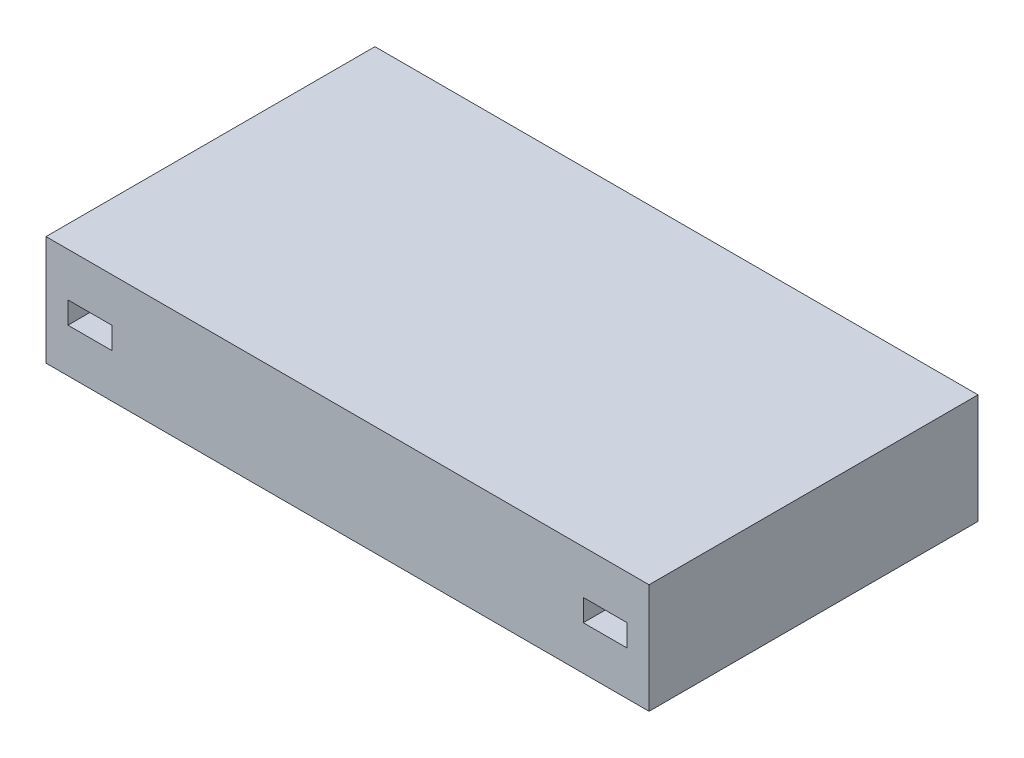
ISO-10303-21;
HEADER;
FILE_DESCRIPTION(('STEP AP214'),'2;1');
FILE_NAME('part.step','',(''),(''),'','','');
FILE_SCHEMA(('AUTOMOTIVE_DESIGN { 1 0 10303 214 1 1 1 1 }'));
ENDSEC;
DATA;
#1=APPLICATION_CONTEXT('core data for automotive mechanical design processes');
#2=APPLICATION_PROTOCOL_DEFINITION('international standard','automotive_design',2000,#1);
#3=PRODUCT_CONTEXT('',#1,'mechanical');
#4=PRODUCT('Part','Part','',(#3));
#5=PRODUCT_RELATED_PRODUCT_CATEGORY('part','',(#4));
#6=PRODUCT_DEFINITION_FORMATION('','',#4);
#7=PRODUCT_DEFINITION_CONTEXT('part definition',#1,'design');
#8=PRODUCT_DEFINITION('design','',#6,#7);
#9=PRODUCT_DEFINITION_SHAPE('','',#8);
#10=(LENGTH_UNIT() NAMED_UNIT(*) SI_UNIT(.MILLI.,.METRE.));
#11=(NAMED_UNIT(*) PLANE_ANGLE_UNIT() SI_UNIT($,.RADIAN.));
#12=(NAMED_UNIT(*) SI_UNIT($,.STERADIAN.) SOLID_ANGLE_UNIT());
#13=UNCERTAINTY_MEASURE_WITH_UNIT(LENGTH_MEASURE(1.E-05),#10,'distance_accuracy_value','');
#14=(GEOMETRIC_REPRESENTATION_CONTEXT(3) GLOBAL_UNCERTAINTY_ASSIGNED_CONTEXT((#13)) GLOBAL_UNIT_ASSIGNED_CONTEXT((#10,
#11,#12)) REPRESENTATION_CONTEXT('',''));
#15=CARTESIAN_POINT('',(0.,0.,0.));
#16=DIRECTION('',(0.,0.,1.));
#17=DIRECTION('',(1.,0.,0.));
#18=AXIS2_PLACEMENT_3D('',#15,#16,#17);
#19=CARTESIAN_POINT('',(550.,0.,-300.));
#20=DIRECTION('',(0.,0.,1.));
#21=DIRECTION('',(1.,0.,0.));
#22=AXIS2_PLACEMENT_3D('',#19,#20,#21);
#23=PLANE('',#22);
#24=DIRECTION('',(0.,-1.,0.));
#25=VECTOR('',#24,1.);
#26=CARTESIAN_POINT('',(490.,60.,-300.));
#27=LINE('',#26,#25);
#28=CARTESIAN_POINT('',(490.,60.,-300.));
#29=VERTEX_POINT('',#28);
#30=CARTESIAN_POINT('',(490.,40.,-300.));
#31=VERTEX_POINT('',#30);
#32=EDGE_CURVE('E57',#29,#31,#27,.T.);
#33=ORIENTED_EDGE('',*,*,#32,.T.);
#34=DIRECTION('',(1.,0.,0.));
#35=VECTOR('',#34,1.);
#36=CARTESIAN_POINT('',(490.,40.,-300.));
#37=LINE('',#36,#35);
#38=CARTESIAN_POINT('',(530.,40.,-300.));
#39=VERTEX_POINT('',#38);
#40=EDGE_CURVE('E217',#31,#39,#37,.T.);
#41=ORIENTED_EDGE('',*,*,#40,.T.);
#42=DIRECTION('',(0.,1.,0.));
#43=VECTOR('',#42,1.);
#44=CARTESIAN_POINT('',(530.,60.,-300.));
#45=LINE('',#44,#43);
#46=CARTESIAN_POINT('',(530.,60.,-300.));
#47=VERTEX_POINT('',#46);
#48=EDGE_CURVE('E228',#39,#47,#45,.T.);
#49=ORIENTED_EDGE('',*,*,#48,.T.);
#50=DIRECTION('',(-1.,0.,0.));
#51=VECTOR('',#50,1.);
#52=CARTESIAN_POINT('',(490.,60.,-300.));
#53=LINE('',#52,#51);
#54=EDGE_CURVE('E225',#47,#29,#53,.T.);
#55=ORIENTED_EDGE('',*,*,#54,.T.);
#56=EDGE_LOOP('',(#33,#41,#49,#55));
#57=FACE_BOUND('',#56,.T.);
#58=DIRECTION('',(0.,1.,0.));
#59=VECTOR('',#58,1.);
#60=CARTESIAN_POINT('',(0.,0.,-300.));
#61=LINE('',#60,#59);
#62=CARTESIAN_POINT('',(0.,0.,-300.));
#63=VERTEX_POINT('',#62);
#64=CARTESIAN_POINT('',(0.,100.,-300.));
#65=VERTEX_POINT('',#64);
#66=EDGE_CURVE('E318',#63,#65,#61,.T.);
#67=ORIENTED_EDGE('',*,*,#66,.T.);
#68=DIRECTION('',(-1.,0.,0.));
#69=VECTOR('',#68,1.);
#70=CARTESIAN_POINT('',(550.,100.,-300.));
#71=LINE('',#70,#69);
#72=CARTESIAN_POINT('',(550.,100.,-300.));
#73=VERTEX_POINT('',#72);
#74=EDGE_CURVE('E323',#73,#65,#71,.T.);
#75=ORIENTED_EDGE('',*,*,#74,.F.);
#76=DIRECTION('',(0.,1.,0.));
#77=VECTOR('',#76,1.);
#78=CARTESIAN_POINT('',(550.,0.,-300.));
#79=LINE('',#78,#77);
#80=CARTESIAN_POINT('',(550.,0.,-300.));
#81=VERTEX_POINT('',#80);
#82=EDGE_CURVE('E309',#81,#73,#79,.T.);
#83=ORIENTED_EDGE('',*,*,#82,.F.);
#84=DIRECTION('',(-1.,0.,0.));
#85=VECTOR('',#84,1.);
#86=CARTESIAN_POINT('',(550.,0.,-300.));
#87=LINE('',#86,#85);
#88=EDGE_CURVE('E42',#81,#63,#87,.T.);
#89=ORIENTED_EDGE('',*,*,#88,.T.);
#90=EDGE_LOOP('',(#67,#75,#83,#89));
#91=FACE_BOUND('',#90,.T.);
#92=DIRECTION('',(0.,-1.,0.));
#93=VECTOR('',#92,1.);
#94=CARTESIAN_POINT('',(20.,60.,-300.));
#95=LINE('',#94,#93);
#96=CARTESIAN_POINT('',(20.,60.,-300.));
#97=VERTEX_POINT('',#96);
#98=CARTESIAN_POINT('',(20.,40.,-300.));
#99=VERTEX_POINT('',#98);
#100=EDGE_CURVE('E49',#97,#99,#95,.T.);
#101=ORIENTED_EDGE('',*,*,#100,.T.);
#102=DIRECTION('',(1.,0.,0.));
#103=VECTOR('',#102,1.);
#104=CARTESIAN_POINT('',(20.,40.,-300.));
#105=LINE('',#104,#103);
#106=CARTESIAN_POINT('',(60.,40.,-300.));
#107=VERTEX_POINT('',#106);
#108=EDGE_CURVE('E193',#99,#107,#105,.T.);
#109=ORIENTED_EDGE('',*,*,#108,.T.);
#110=DIRECTION('',(0.,1.,0.));
#111=VECTOR('',#110,1.);
#112=CARTESIAN_POINT('',(60.,60.,-300.));
#113=LINE('',#112,#111);
#114=CARTESIAN_POINT('',(60.,60.,-300.));
#115=VERTEX_POINT('',#114);
#116=EDGE_CURVE('E196',#107,#115,#113,.T.);
#117=ORIENTED_EDGE('',*,*,#116,.T.);
#118=DIRECTION('',(-1.,0.,0.));
#119=VECTOR('',#118,1.);
#120=CARTESIAN_POINT('',(20.,60.,-300.));
#121=LINE('',#120,#119);
#122=EDGE_CURVE('E202',#115,#97,#121,.T.);
#123=ORIENTED_EDGE('',*,*,#122,.T.);
#124=EDGE_LOOP('',(#101,#109,#117,#123));
#125=FACE_BOUND('',#124,.T.);
#126=ADVANCED_FACE('F34',(#57,#91,#125),#23,.F.);
#127=CARTESIAN_POINT('',(550.,0.,0.));
#128=DIRECTION('',(0.,0.,-1.));
#129=DIRECTION('',(0.,1.,0.));
#130=AXIS2_PLACEMENT_3D('',#127,#128,#129);
#131=PLANE('',#130);
#132=DIRECTION('',(1.,0.,0.));
#133=VECTOR('',#132,1.);
#134=CARTESIAN_POINT('',(20.,40.,0.));
#135=LINE('',#134,#133);
#136=CARTESIAN_POINT('',(20.,40.,0.));
#137=VERTEX_POINT('',#136);
#138=CARTESIAN_POINT('',(60.,40.,0.));
#139=VERTEX_POINT('',#138);
#140=EDGE_CURVE('E255',#137,#139,#135,.T.);
#141=ORIENTED_EDGE('',*,*,#140,.F.);
#142=DIRECTION('',(0.,-1.,0.));
#143=VECTOR('',#142,1.);
#144=CARTESIAN_POINT('',(20.,60.,0.));
#145=LINE('',#144,#143);
#146=CARTESIAN_POINT('',(20.,60.,0.));
#147=VERTEX_POINT('',#146);
#148=EDGE_CURVE('E253',#147,#137,#145,.T.);
#149=ORIENTED_EDGE('',*,*,#148,.F.);
#150=DIRECTION('',(-1.,0.,0.));
#151=VECTOR('',#150,1.);
#152=CARTESIAN_POINT('',(20.,60.,0.));
#153=LINE('',#152,#151);
#154=CARTESIAN_POINT('',(60.,60.,0.));
#155=VERTEX_POINT('',#154);
#156=EDGE_CURVE('E243',#155,#147,#153,.T.);
#157=ORIENTED_EDGE('',*,*,#156,.F.);
#158=DIRECTION('',(0.,1.,0.));
#159=VECTOR('',#158,1.);
#160=CARTESIAN_POINT('',(60.,60.,0.));
#161=LINE('',#160,#159);
#162=EDGE_CURVE('E259',#139,#155,#161,.T.);
#163=ORIENTED_EDGE('',*,*,#162,.F.);
#164=EDGE_LOOP('',(#141,#149,#157,#163));
#165=FACE_BOUND('',#164,.T.);
#166=DIRECTION('',(1.,0.,0.));
#167=VECTOR('',#166,1.);
#168=CARTESIAN_POINT('',(490.,40.,0.));
#169=LINE('',#168,#167);
#170=CARTESIAN_POINT('',(490.,40.,0.));
#171=VERTEX_POINT('',#170);
#172=CARTESIAN_POINT('',(530.,40.,0.));
#173=VERTEX_POINT('',#172);
#174=EDGE_CURVE('E288',#171,#173,#169,.T.);
#175=ORIENTED_EDGE('',*,*,#174,.F.);
#176=DIRECTION('',(0.,-1.,0.));
#177=VECTOR('',#176,1.);
#178=CARTESIAN_POINT('',(490.,60.,0.));
#179=LINE('',#178,#177);
#180=CARTESIAN_POINT('',(490.,60.,0.));
#181=VERTEX_POINT('',#180);
#182=EDGE_CURVE('E209',#181,#171,#179,.T.);
#183=ORIENTED_EDGE('',*,*,#182,.F.);
#184=DIRECTION('',(-1.,0.,0.));
#185=VECTOR('',#184,1.);
#186=CARTESIAN_POINT('',(490.,60.,0.));
#187=LINE('',#186,#185);
#188=CARTESIAN_POINT('',(530.,60.,0.));
#189=VERTEX_POINT('',#188);
#190=EDGE_CURVE('E277',#189,#181,#187,.T.);
#191=ORIENTED_EDGE('',*,*,#190,.F.);
#192=DIRECTION('',(0.,1.,0.));
#193=VECTOR('',#192,1.);
#194=CARTESIAN_POINT('',(530.,60.,0.));
#195=LINE('',#194,#193);
#196=EDGE_CURVE('E291',#173,#189,#195,.T.);
#197=ORIENTED_EDGE('',*,*,#196,.F.);
#198=EDGE_LOOP('',(#175,#183,#191,#197));
#199=FACE_BOUND('',#198,.T.);
#200=DIRECTION('',(0.,-1.,0.));
#201=VECTOR('',#200,1.);
#202=CARTESIAN_POINT('',(0.,0.,0.));
#203=LINE('',#202,#201);
#204=CARTESIAN_POINT('',(0.,100.,0.));
#205=VERTEX_POINT('',#204);
#206=CARTESIAN_POINT('',(0.,0.,0.));
#207=VERTEX_POINT('',#206);
#208=EDGE_CURVE('E266',#205,#207,#203,.T.);
#209=ORIENTED_EDGE('',*,*,#208,.T.);
#210=DIRECTION('',(-1.,0.,0.));
#211=VECTOR('',#210,1.);
#212=CARTESIAN_POINT('',(550.,0.,0.));
#213=LINE('',#212,#211);
#214=CARTESIAN_POINT('',(550.,0.,0.));
#215=VERTEX_POINT('',#214);
#216=EDGE_CURVE('E11',#215,#207,#213,.T.);
#217=ORIENTED_EDGE('',*,*,#216,.F.);
#218=DIRECTION('',(0.,-1.,0.));
#219=VECTOR('',#218,1.);
#220=CARTESIAN_POINT('',(550.,0.,0.));
#221=LINE('',#220,#219);
#222=CARTESIAN_POINT('',(550.,100.,0.));
#223=VERTEX_POINT('',#222);
#224=EDGE_CURVE('E303',#223,#215,#221,.T.);
#225=ORIENTED_EDGE('',*,*,#224,.F.);
#226=DIRECTION('',(-1.,0.,0.));
#227=VECTOR('',#226,1.);
#228=CARTESIAN_POINT('',(550.,100.,0.));
#229=LINE('',#228,#227);
#230=EDGE_CURVE('E313',#223,#205,#229,.T.);
#231=ORIENTED_EDGE('',*,*,#230,.T.);
#232=EDGE_LOOP('',(#209,#217,#225,#231));
#233=FACE_BOUND('',#232,.T.);
#234=ADVANCED_FACE('F36',(#165,#199,#233),#131,.F.);
#235=CARTESIAN_POINT('',(550.,0.,0.));
#236=DIRECTION('',(0.,1.,0.));
#237=DIRECTION('',(0.,0.,1.));
#238=AXIS2_PLACEMENT_3D('',#235,#236,#237);
#239=PLANE('',#238);
#240=DIRECTION('',(0.,0.,-1.));
#241=VECTOR('',#240,1.);
#242=CARTESIAN_POINT('',(0.,0.,0.));
#243=LINE('',#242,#241);
#244=EDGE_CURVE('E316',#207,#63,#243,.T.);
#245=ORIENTED_EDGE('',*,*,#244,.T.);
#246=ORIENTED_EDGE('',*,*,#88,.F.);
#247=DIRECTION('',(0.,0.,-1.));
#248=VECTOR('',#247,1.);
#249=CARTESIAN_POINT('',(550.,0.,0.));
#250=LINE('',#249,#248);
#251=EDGE_CURVE('E306',#215,#81,#250,.T.);
#252=ORIENTED_EDGE('',*,*,#251,.F.);
#253=ORIENTED_EDGE('',*,*,#216,.T.);
#254=EDGE_LOOP('',(#245,#246,#252,#253));
#255=FACE_BOUND('',#254,.T.);
#256=ADVANCED_FACE('F346',(#255),#239,.F.);
#257=CARTESIAN_POINT('',(550.,100.,0.));
#258=DIRECTION('',(0.,-1.,0.));
#259=DIRECTION('',(0.,0.,-1.));
#260=AXIS2_PLACEMENT_3D('',#257,#258,#259);
#261=PLANE('',#260);
#262=DIRECTION('',(0.,0.,1.));
#263=VECTOR('',#262,1.);
#264=CARTESIAN_POINT('',(0.,100.,0.));
#265=LINE('',#264,#263);
#266=EDGE_CURVE('E307',#65,#205,#265,.T.);
#267=ORIENTED_EDGE('',*,*,#266,.T.);
#268=ORIENTED_EDGE('',*,*,#230,.F.);
#269=DIRECTION('',(0.,0.,1.));
#270=VECTOR('',#269,1.);
#271=CARTESIAN_POINT('',(550.,100.,0.));
#272=LINE('',#271,#270);
#273=EDGE_CURVE('E311',#73,#223,#272,.T.);
#274=ORIENTED_EDGE('',*,*,#273,.F.);
#275=ORIENTED_EDGE('',*,*,#74,.T.);
#276=EDGE_LOOP('',(#267,#268,#274,#275));
#277=FACE_BOUND('',#276,.T.);
#278=ADVANCED_FACE('F339',(#277),#261,.F.);
#279=CARTESIAN_POINT('',(550.,0.,0.));
#280=DIRECTION('',(-1.,0.,0.));
#281=DIRECTION('',(0.,0.,1.));
#282=AXIS2_PLACEMENT_3D('',#279,#280,#281);
#283=PLANE('',#282);
#284=ORIENTED_EDGE('',*,*,#224,.T.);
#285=ORIENTED_EDGE('',*,*,#251,.T.);
#286=ORIENTED_EDGE('',*,*,#82,.T.);
#287=ORIENTED_EDGE('',*,*,#273,.T.);
#288=EDGE_LOOP('',(#284,#285,#286,#287));
#289=FACE_BOUND('',#288,.T.);
#290=ADVANCED_FACE('F345',(#289),#283,.F.);
#291=CARTESIAN_POINT('',(0.,0.,0.));
#292=DIRECTION('',(-1.,0.,0.));
#293=DIRECTION('',(0.,0.,1.));
#294=AXIS2_PLACEMENT_3D('',#291,#292,#293);
#295=PLANE('',#294);
#296=ORIENTED_EDGE('',*,*,#208,.F.);
#297=ORIENTED_EDGE('',*,*,#266,.F.);
#298=ORIENTED_EDGE('',*,*,#66,.F.);
#299=ORIENTED_EDGE('',*,*,#244,.F.);
#300=EDGE_LOOP('',(#296,#297,#298,#299));
#301=FACE_BOUND('',#300,.T.);
#302=ADVANCED_FACE('F336',(#301),#295,.T.);
#303=CARTESIAN_POINT('',(490.,60.,-25.));
#304=DIRECTION('',(-1.,0.,0.));
#305=DIRECTION('',(0.,0.,1.));
#306=AXIS2_PLACEMENT_3D('',#303,#304,#305);
#307=PLANE('',#306);
#308=ORIENTED_EDGE('',*,*,#182,.T.);
#309=DIRECTION('',(0.,0.,1.));
#310=VECTOR('',#309,1.);
#311=CARTESIAN_POINT('',(490.,40.,-25.));
#312=LINE('',#311,#310);
#313=CARTESIAN_POINT('',(490.,40.,-25.));
#314=VERTEX_POINT('',#313);
#315=EDGE_CURVE('E286',#314,#171,#312,.T.);
#316=ORIENTED_EDGE('',*,*,#315,.F.);
#317=DIRECTION('',(0.,-1.,0.));
#318=VECTOR('',#317,1.);
#319=CARTESIAN_POINT('',(490.,60.,-25.));
#320=LINE('',#319,#318);
#321=CARTESIAN_POINT('',(490.,60.,-25.));
#322=VERTEX_POINT('',#321);
#323=EDGE_CURVE('E273',#322,#314,#320,.T.);
#324=ORIENTED_EDGE('',*,*,#323,.F.);
#325=DIRECTION('',(0.,0.,1.));
#326=VECTOR('',#325,1.);
#327=CARTESIAN_POINT('',(490.,60.,-25.));
#328=LINE('',#327,#326);
#329=EDGE_CURVE('E256',#322,#181,#328,.T.);
#330=ORIENTED_EDGE('',*,*,#329,.T.);
#331=EDGE_LOOP('',(#308,#316,#324,#330));
#332=FACE_BOUND('',#331,.T.);
#333=ADVANCED_FACE('F362',(#332),#307,.F.);
#334=CARTESIAN_POINT('',(490.,60.,-25.));
#335=DIRECTION('',(0.,1.,0.));
#336=DIRECTION('',(0.,0.,1.));
#337=AXIS2_PLACEMENT_3D('',#334,#335,#336);
#338=PLANE('',#337);
#339=ORIENTED_EDGE('',*,*,#190,.T.);
#340=ORIENTED_EDGE('',*,*,#329,.F.);
#341=DIRECTION('',(-1.,0.,0.));
#342=VECTOR('',#341,1.);
#343=CARTESIAN_POINT('',(490.,60.,-25.));
#344=LINE('',#343,#342);
#345=CARTESIAN_POINT('',(530.,60.,-25.));
#346=VERTEX_POINT('',#345);
#347=EDGE_CURVE('E283',#346,#322,#344,.T.);
#348=ORIENTED_EDGE('',*,*,#347,.F.);
#349=DIRECTION('',(0.,0.,1.));
#350=VECTOR('',#349,1.);
#351=CARTESIAN_POINT('',(530.,60.,-25.));
#352=LINE('',#351,#350);
#353=EDGE_CURVE('E297',#346,#189,#352,.T.);
#354=ORIENTED_EDGE('',*,*,#353,.T.);
#355=EDGE_LOOP('',(#339,#340,#348,#354));
#356=FACE_BOUND('',#355,.T.);
#357=ADVANCED_FACE('F367',(#356),#338,.F.);
#358=CARTESIAN_POINT('',(530.,60.,-25.));
#359=DIRECTION('',(1.,0.,0.));
#360=DIRECTION('',(0.,0.,-1.));
#361=AXIS2_PLACEMENT_3D('',#358,#359,#360);
#362=PLANE('',#361);
#363=ORIENTED_EDGE('',*,*,#196,.T.);
#364=ORIENTED_EDGE('',*,*,#353,.F.);
#365=DIRECTION('',(0.,1.,0.));
#366=VECTOR('',#365,1.);
#367=CARTESIAN_POINT('',(530.,60.,-25.));
#368=LINE('',#367,#366);
#369=CARTESIAN_POINT('',(530.,40.,-25.));
#370=VERTEX_POINT('',#369);
#371=EDGE_CURVE('E280',#370,#346,#368,.T.);
#372=ORIENTED_EDGE('',*,*,#371,.F.);
#373=DIRECTION('',(0.,0.,1.));
#374=VECTOR('',#373,1.);
#375=CARTESIAN_POINT('',(530.,40.,-25.));
#376=LINE('',#375,#374);
#377=EDGE_CURVE('E299',#370,#173,#376,.T.);
#378=ORIENTED_EDGE('',*,*,#377,.T.);
#379=EDGE_LOOP('',(#363,#364,#372,#378));
#380=FACE_BOUND('',#379,.T.);
#381=ADVANCED_FACE('F373',(#380),#362,.F.);
#382=CARTESIAN_POINT('',(490.,40.,-25.));
#383=DIRECTION('',(0.,-1.,0.));
#384=DIRECTION('',(1.,0.,0.));
#385=AXIS2_PLACEMENT_3D('',#382,#383,#384);
#386=PLANE('',#385);
#387=ORIENTED_EDGE('',*,*,#174,.T.);
#388=ORIENTED_EDGE('',*,*,#377,.F.);
#389=DIRECTION('',(1.,0.,0.));
#390=VECTOR('',#389,1.);
#391=CARTESIAN_POINT('',(490.,40.,-25.));
#392=LINE('',#391,#390);
#393=EDGE_CURVE('E276',#314,#370,#392,.T.);
#394=ORIENTED_EDGE('',*,*,#393,.F.);
#395=ORIENTED_EDGE('',*,*,#315,.T.);
#396=EDGE_LOOP('',(#387,#388,#394,#395));
#397=FACE_BOUND('',#396,.T.);
#398=ADVANCED_FACE('F369',(#397),#386,.F.);
#399=CARTESIAN_POINT('',(0.,0.,-25.));
#400=DIRECTION('',(0.,0.,1.));
#401=DIRECTION('',(1.,0.,0.));
#402=AXIS2_PLACEMENT_3D('',#399,#400,#401);
#403=PLANE('',#402);
#404=ORIENTED_EDGE('',*,*,#323,.T.);
#405=ORIENTED_EDGE('',*,*,#393,.T.);
#406=ORIENTED_EDGE('',*,*,#371,.T.);
#407=ORIENTED_EDGE('',*,*,#347,.T.);
#408=EDGE_LOOP('',(#404,#405,#406,#407));
#409=FACE_BOUND('',#408,.T.);
#410=ADVANCED_FACE('F372',(#409),#403,.T.);
#411=CARTESIAN_POINT('',(20.,60.,-25.));
#412=DIRECTION('',(-1.,0.,0.));
#413=DIRECTION('',(0.,-1.,0.));
#414=AXIS2_PLACEMENT_3D('',#411,#412,#413);
#415=PLANE('',#414);
#416=ORIENTED_EDGE('',*,*,#148,.T.);
#417=DIRECTION('',(0.,0.,1.));
#418=VECTOR('',#417,1.);
#419=CARTESIAN_POINT('',(20.,40.,-25.));
#420=LINE('',#419,#418);
#421=CARTESIAN_POINT('',(20.,40.,-25.));
#422=VERTEX_POINT('',#421);
#423=EDGE_CURVE('E252',#422,#137,#420,.T.);
#424=ORIENTED_EDGE('',*,*,#423,.F.);
#425=DIRECTION('',(0.,-1.,0.));
#426=VECTOR('',#425,1.);
#427=CARTESIAN_POINT('',(20.,60.,-25.));
#428=LINE('',#427,#426);
#429=CARTESIAN_POINT('',(20.,60.,-25.));
#430=VERTEX_POINT('',#429);
#431=EDGE_CURVE('E239',#430,#422,#428,.T.);
#432=ORIENTED_EDGE('',*,*,#431,.F.);
#433=DIRECTION('',(0.,0.,1.));
#434=VECTOR('',#433,1.);
#435=CARTESIAN_POINT('',(20.,60.,-25.));
#436=LINE('',#435,#434);
#437=EDGE_CURVE('E264',#430,#147,#436,.T.);
#438=ORIENTED_EDGE('',*,*,#437,.T.);
#439=EDGE_LOOP('',(#416,#424,#432,#438));
#440=FACE_BOUND('',#439,.T.);
#441=ADVANCED_FACE('F383',(#440),#415,.F.);
#442=CARTESIAN_POINT('',(20.,60.,-25.));
#443=DIRECTION('',(0.,1.,0.));
#444=DIRECTION('',(0.,0.,1.));
#445=AXIS2_PLACEMENT_3D('',#442,#443,#444);
#446=PLANE('',#445);
#447=ORIENTED_EDGE('',*,*,#156,.T.);
#448=ORIENTED_EDGE('',*,*,#437,.F.);
#449=DIRECTION('',(-1.,0.,0.));
#450=VECTOR('',#449,1.);
#451=CARTESIAN_POINT('',(20.,60.,-25.));
#452=LINE('',#451,#450);
#453=CARTESIAN_POINT('',(60.,60.,-25.));
#454=VERTEX_POINT('',#453);
#455=EDGE_CURVE('E249',#454,#430,#452,.T.);
#456=ORIENTED_EDGE('',*,*,#455,.F.);
#457=DIRECTION('',(0.,0.,1.));
#458=VECTOR('',#457,1.);
#459=CARTESIAN_POINT('',(60.,60.,-25.));
#460=LINE('',#459,#458);
#461=EDGE_CURVE('E267',#454,#155,#460,.T.);
#462=ORIENTED_EDGE('',*,*,#461,.T.);
#463=EDGE_LOOP('',(#447,#448,#456,#462));
#464=FACE_BOUND('',#463,.T.);
#465=ADVANCED_FACE('F387',(#464),#446,.F.);
#466=CARTESIAN_POINT('',(60.,60.,-25.));
#467=DIRECTION('',(1.,0.,0.));
#468=DIRECTION('',(0.,1.,0.));
#469=AXIS2_PLACEMENT_3D('',#466,#467,#468);
#470=PLANE('',#469);
#471=ORIENTED_EDGE('',*,*,#162,.T.);
#472=ORIENTED_EDGE('',*,*,#461,.F.);
#473=DIRECTION('',(0.,1.,0.));
#474=VECTOR('',#473,1.);
#475=CARTESIAN_POINT('',(60.,60.,-25.));
#476=LINE('',#475,#474);
#477=CARTESIAN_POINT('',(60.,40.,-25.));
#478=VERTEX_POINT('',#477);
#479=EDGE_CURVE('E246',#478,#454,#476,.T.);
#480=ORIENTED_EDGE('',*,*,#479,.F.);
#481=DIRECTION('',(0.,0.,1.));
#482=VECTOR('',#481,1.);
#483=CARTESIAN_POINT('',(60.,40.,-25.));
#484=LINE('',#483,#482);
#485=EDGE_CURVE('E269',#478,#139,#484,.T.);
#486=ORIENTED_EDGE('',*,*,#485,.T.);
#487=EDGE_LOOP('',(#471,#472,#480,#486));
#488=FACE_BOUND('',#487,.T.);
#489=ADVANCED_FACE('F393',(#488),#470,.F.);
#490=CARTESIAN_POINT('',(20.,40.,-25.));
#491=DIRECTION('',(0.,-1.,0.));
#492=DIRECTION('',(0.,0.,-1.));
#493=AXIS2_PLACEMENT_3D('',#490,#491,#492);
#494=PLANE('',#493);
#495=ORIENTED_EDGE('',*,*,#140,.T.);
#496=ORIENTED_EDGE('',*,*,#485,.F.);
#497=DIRECTION('',(1.,0.,0.));
#498=VECTOR('',#497,1.);
#499=CARTESIAN_POINT('',(20.,40.,-25.));
#500=LINE('',#499,#498);
#501=EDGE_CURVE('E242',#422,#478,#500,.T.);
#502=ORIENTED_EDGE('',*,*,#501,.F.);
#503=ORIENTED_EDGE('',*,*,#423,.T.);
#504=EDGE_LOOP('',(#495,#496,#502,#503));
#505=FACE_BOUND('',#504,.T.);
#506=ADVANCED_FACE('F389',(#505),#494,.F.);
#507=CARTESIAN_POINT('',(0.,0.,-25.));
#508=DIRECTION('',(0.,0.,1.));
#509=DIRECTION('',(1.,0.,0.));
#510=AXIS2_PLACEMENT_3D('',#507,#508,#509);
#511=PLANE('',#510);
#512=ORIENTED_EDGE('',*,*,#431,.T.);
#513=ORIENTED_EDGE('',*,*,#501,.T.);
#514=ORIENTED_EDGE('',*,*,#479,.T.);
#515=ORIENTED_EDGE('',*,*,#455,.T.);
#516=EDGE_LOOP('',(#512,#513,#514,#515));
#517=FACE_BOUND('',#516,.T.);
#518=ADVANCED_FACE('F392',(#517),#511,.T.);
#519=CARTESIAN_POINT('',(490.,60.,-275.));
#520=DIRECTION('',(1.,0.,0.));
#521=DIRECTION('',(0.,0.,-1.));
#522=AXIS2_PLACEMENT_3D('',#519,#520,#521);
#523=PLANE('',#522);
#524=ORIENTED_EDGE('',*,*,#32,.F.);
#525=DIRECTION('',(0.,0.,-1.));
#526=VECTOR('',#525,1.);
#527=CARTESIAN_POINT('',(490.,60.,-275.));
#528=LINE('',#527,#526);
#529=CARTESIAN_POINT('',(490.,60.,-275.));
#530=VERTEX_POINT('',#529);
#531=EDGE_CURVE('E223',#530,#29,#528,.T.);
#532=ORIENTED_EDGE('',*,*,#531,.F.);
#533=DIRECTION('',(0.,-1.,0.));
#534=VECTOR('',#533,1.);
#535=CARTESIAN_POINT('',(490.,60.,-275.));
#536=LINE('',#535,#534);
#537=CARTESIAN_POINT('',(490.,40.,-275.));
#538=VERTEX_POINT('',#537);
#539=EDGE_CURVE('E213',#530,#538,#536,.T.);
#540=ORIENTED_EDGE('',*,*,#539,.T.);
#541=DIRECTION('',(0.,0.,-1.));
#542=VECTOR('',#541,1.);
#543=CARTESIAN_POINT('',(490.,40.,-275.));
#544=LINE('',#543,#542);
#545=EDGE_CURVE('E203',#538,#31,#544,.T.);
#546=ORIENTED_EDGE('',*,*,#545,.T.);
#547=EDGE_LOOP('',(#524,#532,#540,#546));
#548=FACE_BOUND('',#547,.T.);
#549=ADVANCED_FACE('F403',(#548),#523,.T.);
#550=CARTESIAN_POINT('',(490.,40.,-275.));
#551=DIRECTION('',(0.,1.,0.));
#552=DIRECTION('',(-1.,0.,0.));
#553=AXIS2_PLACEMENT_3D('',#550,#551,#552);
#554=PLANE('',#553);
#555=ORIENTED_EDGE('',*,*,#40,.F.);
#556=ORIENTED_EDGE('',*,*,#545,.F.);
#557=DIRECTION('',(1.,0.,0.));
#558=VECTOR('',#557,1.);
#559=CARTESIAN_POINT('',(490.,40.,-275.));
#560=LINE('',#559,#558);
#561=CARTESIAN_POINT('',(530.,40.,-275.));
#562=VERTEX_POINT('',#561);
#563=EDGE_CURVE('E221',#538,#562,#560,.T.);
#564=ORIENTED_EDGE('',*,*,#563,.T.);
#565=DIRECTION('',(0.,0.,-1.));
#566=VECTOR('',#565,1.);
#567=CARTESIAN_POINT('',(530.,40.,-275.));
#568=LINE('',#567,#566);
#569=EDGE_CURVE('E234',#562,#39,#568,.T.);
#570=ORIENTED_EDGE('',*,*,#569,.T.);
#571=EDGE_LOOP('',(#555,#556,#564,#570));
#572=FACE_BOUND('',#571,.T.);
#573=ADVANCED_FACE('F407',(#572),#554,.T.);
#574=CARTESIAN_POINT('',(530.,60.,-275.));
#575=DIRECTION('',(-1.,0.,0.));
#576=DIRECTION('',(0.,0.,1.));
#577=AXIS2_PLACEMENT_3D('',#574,#575,#576);
#578=PLANE('',#577);
#579=ORIENTED_EDGE('',*,*,#48,.F.);
#580=ORIENTED_EDGE('',*,*,#569,.F.);
#581=DIRECTION('',(0.,1.,0.));
#582=VECTOR('',#581,1.);
#583=CARTESIAN_POINT('',(530.,60.,-275.));
#584=LINE('',#583,#582);
#585=CARTESIAN_POINT('',(530.,60.,-275.));
#586=VERTEX_POINT('',#585);
#587=EDGE_CURVE('E219',#562,#586,#584,.T.);
#588=ORIENTED_EDGE('',*,*,#587,.T.);
#589=DIRECTION('',(0.,0.,-1.));
#590=VECTOR('',#589,1.);
#591=CARTESIAN_POINT('',(530.,60.,-275.));
#592=LINE('',#591,#590);
#593=EDGE_CURVE('E236',#586,#47,#592,.T.);
#594=ORIENTED_EDGE('',*,*,#593,.T.);
#595=EDGE_LOOP('',(#579,#580,#588,#594));
#596=FACE_BOUND('',#595,.T.);
#597=ADVANCED_FACE('F412',(#596),#578,.T.);
#598=CARTESIAN_POINT('',(490.,60.,-275.));
#599=DIRECTION('',(0.,-1.,0.));
#600=DIRECTION('',(0.,0.,-1.));
#601=AXIS2_PLACEMENT_3D('',#598,#599,#600);
#602=PLANE('',#601);
#603=ORIENTED_EDGE('',*,*,#54,.F.);
#604=ORIENTED_EDGE('',*,*,#593,.F.);
#605=DIRECTION('',(-1.,0.,0.));
#606=VECTOR('',#605,1.);
#607=CARTESIAN_POINT('',(490.,60.,-275.));
#608=LINE('',#607,#606);
#609=EDGE_CURVE('E216',#586,#530,#608,.T.);
#610=ORIENTED_EDGE('',*,*,#609,.T.);
#611=ORIENTED_EDGE('',*,*,#531,.T.);
#612=EDGE_LOOP('',(#603,#604,#610,#611));
#613=FACE_BOUND('',#612,.T.);
#614=ADVANCED_FACE('F408',(#613),#602,.T.);
#615=CARTESIAN_POINT('',(0.,0.,-275.));
#616=DIRECTION('',(0.,0.,-1.));
#617=DIRECTION('',(1.,0.,0.));
#618=AXIS2_PLACEMENT_3D('',#615,#616,#617);
#619=PLANE('',#618);
#620=ORIENTED_EDGE('',*,*,#539,.F.);
#621=ORIENTED_EDGE('',*,*,#609,.F.);
#622=ORIENTED_EDGE('',*,*,#587,.F.);
#623=ORIENTED_EDGE('',*,*,#563,.F.);
#624=EDGE_LOOP('',(#620,#621,#622,#623));
#625=FACE_BOUND('',#624,.T.);
#626=ADVANCED_FACE('F411',(#625),#619,.T.);
#627=CARTESIAN_POINT('',(20.,60.,-275.));
#628=DIRECTION('',(1.,0.,0.));
#629=DIRECTION('',(0.,1.,0.));
#630=AXIS2_PLACEMENT_3D('',#627,#628,#629);
#631=PLANE('',#630);
#632=ORIENTED_EDGE('',*,*,#100,.F.);
#633=DIRECTION('',(0.,0.,-1.));
#634=VECTOR('',#633,1.);
#635=CARTESIAN_POINT('',(20.,60.,-275.));
#636=LINE('',#635,#634);
#637=CARTESIAN_POINT('',(20.,60.,-275.));
#638=VERTEX_POINT('',#637);
#639=EDGE_CURVE('E178',#638,#97,#636,.T.);
#640=ORIENTED_EDGE('',*,*,#639,.F.);
#641=DIRECTION('',(0.,-1.,0.));
#642=VECTOR('',#641,1.);
#643=CARTESIAN_POINT('',(20.,60.,-275.));
#644=LINE('',#643,#642);
#645=CARTESIAN_POINT('',(20.,40.,-275.));
#646=VERTEX_POINT('',#645);
#647=EDGE_CURVE('E185',#638,#646,#644,.T.);
#648=ORIENTED_EDGE('',*,*,#647,.T.);
#649=DIRECTION('',(0.,0.,-1.));
#650=VECTOR('',#649,1.);
#651=CARTESIAN_POINT('',(20.,40.,-275.));
#652=LINE('',#651,#650);
#653=EDGE_CURVE('E207',#646,#99,#652,.T.);
#654=ORIENTED_EDGE('',*,*,#653,.T.);
#655=EDGE_LOOP('',(#632,#640,#648,#654));
#656=FACE_BOUND('',#655,.T.);
#657=ADVANCED_FACE('F188',(#656),#631,.T.);
#658=CARTESIAN_POINT('',(20.,40.,-275.));
#659=DIRECTION('',(0.,1.,0.));
#660=DIRECTION('',(0.,0.,1.));
#661=AXIS2_PLACEMENT_3D('',#658,#659,#660);
#662=PLANE('',#661);
#663=ORIENTED_EDGE('',*,*,#108,.F.);
#664=ORIENTED_EDGE('',*,*,#653,.F.);
#665=DIRECTION('',(1.,0.,0.));
#666=VECTOR('',#665,1.);
#667=CARTESIAN_POINT('',(20.,40.,-275.));
#668=LINE('',#667,#666);
#669=CARTESIAN_POINT('',(60.,40.,-275.));
#670=VERTEX_POINT('',#669);
#671=EDGE_CURVE('E190',#646,#670,#668,.T.);
#672=ORIENTED_EDGE('',*,*,#671,.T.);
#673=DIRECTION('',(0.,0.,-1.));
#674=VECTOR('',#673,1.);
#675=CARTESIAN_POINT('',(60.,40.,-275.));
#676=LINE('',#675,#674);
#677=EDGE_CURVE('E210',#670,#107,#676,.T.);
#678=ORIENTED_EDGE('',*,*,#677,.T.);
#679=EDGE_LOOP('',(#663,#664,#672,#678));
#680=FACE_BOUND('',#679,.T.);
#681=ADVANCED_FACE('F425',(#680),#662,.T.);
#682=CARTESIAN_POINT('',(60.,60.,-275.));
#683=DIRECTION('',(-1.,0.,0.));
#684=DIRECTION('',(0.,-1.,0.));
#685=AXIS2_PLACEMENT_3D('',#682,#683,#684);
#686=PLANE('',#685);
#687=ORIENTED_EDGE('',*,*,#116,.F.);
#688=ORIENTED_EDGE('',*,*,#677,.F.);
#689=DIRECTION('',(0.,1.,0.));
#690=VECTOR('',#689,1.);
#691=CARTESIAN_POINT('',(60.,60.,-275.));
#692=LINE('',#691,#690);
#693=CARTESIAN_POINT('',(60.,60.,-275.));
#694=VERTEX_POINT('',#693);
#695=EDGE_CURVE('E184',#670,#694,#692,.T.);
#696=ORIENTED_EDGE('',*,*,#695,.T.);
#697=DIRECTION('',(0.,0.,-1.));
#698=VECTOR('',#697,1.);
#699=CARTESIAN_POINT('',(60.,60.,-275.));
#700=LINE('',#699,#698);
#701=EDGE_CURVE('E180',#694,#115,#700,.T.);
#702=ORIENTED_EDGE('',*,*,#701,.T.);
#703=EDGE_LOOP('',(#687,#688,#696,#702));
#704=FACE_BOUND('',#703,.T.);
#705=ADVANCED_FACE('F428',(#704),#686,.T.);
#706=CARTESIAN_POINT('',(20.,60.,-275.));
#707=DIRECTION('',(0.,-1.,0.));
#708=DIRECTION('',(0.,0.,-1.));
#709=AXIS2_PLACEMENT_3D('',#706,#707,#708);
#710=PLANE('',#709);
#711=ORIENTED_EDGE('',*,*,#122,.F.);
#712=ORIENTED_EDGE('',*,*,#701,.F.);
#713=DIRECTION('',(-1.,0.,0.));
#714=VECTOR('',#713,1.);
#715=CARTESIAN_POINT('',(20.,60.,-275.));
#716=LINE('',#715,#714);
#717=EDGE_CURVE('E175',#694,#638,#716,.T.);
#718=ORIENTED_EDGE('',*,*,#717,.T.);
#719=ORIENTED_EDGE('',*,*,#639,.T.);
#720=EDGE_LOOP('',(#711,#712,#718,#719));
#721=FACE_BOUND('',#720,.T.);
#722=ADVANCED_FACE('F177',(#721),#710,.T.);
#723=CARTESIAN_POINT('',(0.,0.,-275.));
#724=DIRECTION('',(0.,0.,-1.));
#725=DIRECTION('',(1.,0.,0.));
#726=AXIS2_PLACEMENT_3D('',#723,#724,#725);
#727=PLANE('',#726);
#728=ORIENTED_EDGE('',*,*,#647,.F.);
#729=ORIENTED_EDGE('',*,*,#717,.F.);
#730=ORIENTED_EDGE('',*,*,#695,.F.);
#731=ORIENTED_EDGE('',*,*,#671,.F.);
#732=EDGE_LOOP('',(#728,#729,#730,#731));
#733=FACE_BOUND('',#732,.T.);
#734=ADVANCED_FACE('F192',(#733),#727,.T.);
#735=CLOSED_SHELL('',(#126,#234,#256,#278,#290,#302,#333,#357,#381,#398,#410,#441,#465,#489,
#506,#518,#549,#573,#597,#614,#626,#657,#681,#705,#722,#734));
#736=MANIFOLD_SOLID_BREP('B2',#735);
#737=ADVANCED_BREP_SHAPE_REPRESENTATION('',(#18,#736),#14);
#738=SHAPE_DEFINITION_REPRESENTATION(#9,#737);
ENDSEC;
END-ISO-10303-21;
